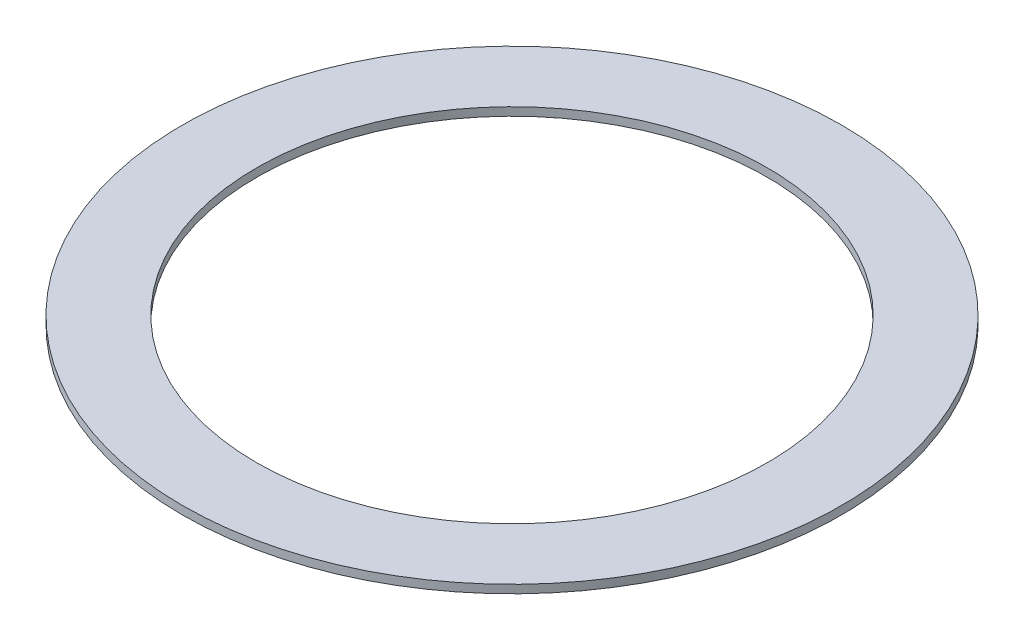
ISO-10303-21;
HEADER;
FILE_DESCRIPTION(('STEP AP214'),'2;1');
FILE_NAME('part.step','',(''),(''),'','','');
FILE_SCHEMA(('AUTOMOTIVE_DESIGN { 1 0 10303 214 1 1 1 1 }'));
ENDSEC;
DATA;
#1=APPLICATION_CONTEXT('core data for automotive mechanical design processes');
#2=APPLICATION_PROTOCOL_DEFINITION('international standard','automotive_design',2000,#1);
#3=PRODUCT_CONTEXT('',#1,'mechanical');
#4=PRODUCT('Part','Part','',(#3));
#5=PRODUCT_RELATED_PRODUCT_CATEGORY('part','',(#4));
#6=PRODUCT_DEFINITION_FORMATION('','',#4);
#7=PRODUCT_DEFINITION_CONTEXT('part definition',#1,'design');
#8=PRODUCT_DEFINITION('design','',#6,#7);
#9=PRODUCT_DEFINITION_SHAPE('','',#8);
#10=(LENGTH_UNIT() NAMED_UNIT(*) SI_UNIT(.MILLI.,.METRE.));
#11=(NAMED_UNIT(*) PLANE_ANGLE_UNIT() SI_UNIT($,.RADIAN.));
#12=(NAMED_UNIT(*) SI_UNIT($,.STERADIAN.) SOLID_ANGLE_UNIT());
#13=UNCERTAINTY_MEASURE_WITH_UNIT(LENGTH_MEASURE(1.E-05),#10,'distance_accuracy_value','');
#14=(GEOMETRIC_REPRESENTATION_CONTEXT(3) GLOBAL_UNCERTAINTY_ASSIGNED_CONTEXT((#13)) GLOBAL_UNIT_ASSIGNED_CONTEXT((#10,
#11,#12)) REPRESENTATION_CONTEXT('',''));
#15=CARTESIAN_POINT('',(0.,0.,0.));
#16=DIRECTION('',(0.,0.,1.));
#17=DIRECTION('',(1.,0.,0.));
#18=AXIS2_PLACEMENT_3D('',#15,#16,#17);
#19=CARTESIAN_POINT('',(0.,0.5,0.));
#20=DIRECTION('',(0.,1.,0.));
#21=DIRECTION('',(0.,0.,1.));
#22=AXIS2_PLACEMENT_3D('',#19,#20,#21);
#23=PLANE('',#22);
#24=CARTESIAN_POINT('',(0.,0.5,0.));
#25=DIRECTION('',(0.,1.,0.));
#26=DIRECTION('',(0.,0.,1.));
#27=AXIS2_PLACEMENT_3D('',#24,#25,#26);
#28=CIRCLE('',#27,20.);
#29=CARTESIAN_POINT('',(0.,0.5,20.));
#30=VERTEX_POINT('',#29);
#31=EDGE_CURVE('E10',#30,#30,#28,.T.);
#32=ORIENTED_EDGE('',*,*,#31,.T.);
#33=EDGE_LOOP('',(#32));
#34=FACE_BOUND('',#33,.T.);
#35=CARTESIAN_POINT('',(0.,0.5,0.));
#36=DIRECTION('',(0.,1.,0.));
#37=DIRECTION('',(0.,0.,1.));
#38=AXIS2_PLACEMENT_3D('',#35,#36,#37);
#39=CIRCLE('',#38,15.5);
#40=CARTESIAN_POINT('',(0.,0.5,15.5));
#41=VERTEX_POINT('',#40);
#42=EDGE_CURVE('E45',#41,#41,#39,.T.);
#43=ORIENTED_EDGE('',*,*,#42,.F.);
#44=EDGE_LOOP('',(#43));
#45=FACE_BOUND('',#44,.T.);
#46=ADVANCED_FACE('F34',(#34,#45),#23,.T.);
#47=CARTESIAN_POINT('',(0.,0.,0.));
#48=DIRECTION('',(0.,1.,0.));
#49=DIRECTION('',(0.,0.,1.));
#50=AXIS2_PLACEMENT_3D('',#47,#48,#49);
#51=PLANE('',#50);
#52=CARTESIAN_POINT('',(0.,0.,0.));
#53=DIRECTION('',(0.,1.,0.));
#54=DIRECTION('',(0.,0.,1.));
#55=AXIS2_PLACEMENT_3D('',#52,#53,#54);
#56=CIRCLE('',#55,20.);
#57=CARTESIAN_POINT('',(0.,0.,20.));
#58=VERTEX_POINT('',#57);
#59=EDGE_CURVE('E38',#58,#58,#56,.T.);
#60=ORIENTED_EDGE('',*,*,#59,.F.);
#61=EDGE_LOOP('',(#60));
#62=FACE_BOUND('',#61,.T.);
#63=CARTESIAN_POINT('',(0.,0.,0.));
#64=DIRECTION('',(0.,1.,0.));
#65=DIRECTION('',(0.,0.,1.));
#66=AXIS2_PLACEMENT_3D('',#63,#64,#65);
#67=CIRCLE('',#66,15.5);
#68=CARTESIAN_POINT('',(0.,0.,15.5));
#69=VERTEX_POINT('',#68);
#70=EDGE_CURVE('E47',#69,#69,#67,.T.);
#71=ORIENTED_EDGE('',*,*,#70,.T.);
#72=EDGE_LOOP('',(#71));
#73=FACE_BOUND('',#72,.T.);
#74=ADVANCED_FACE('F57',(#62,#73),#51,.F.);
#75=CARTESIAN_POINT('',(0.,0.5,0.));
#76=DIRECTION('',(0.,-1.,0.));
#77=DIRECTION('',(0.,0.,-1.));
#78=AXIS2_PLACEMENT_3D('',#75,#76,#77);
#79=CYLINDRICAL_SURFACE('',#78,20.);
#80=ORIENTED_EDGE('',*,*,#31,.F.);
#81=EDGE_LOOP('',(#80));
#82=FACE_BOUND('',#81,.T.);
#83=ORIENTED_EDGE('',*,*,#59,.T.);
#84=EDGE_LOOP('',(#83));
#85=FACE_BOUND('',#84,.T.);
#86=ADVANCED_FACE('F36',(#82,#85),#79,.T.);
#87=CARTESIAN_POINT('',(0.,0.5,0.));
#88=DIRECTION('',(0.,-1.,0.));
#89=DIRECTION('',(0.,0.,-1.));
#90=AXIS2_PLACEMENT_3D('',#87,#88,#89);
#91=CYLINDRICAL_SURFACE('',#90,15.5);
#92=ORIENTED_EDGE('',*,*,#42,.T.);
#93=EDGE_LOOP('',(#92));
#94=FACE_BOUND('',#93,.T.);
#95=ORIENTED_EDGE('',*,*,#70,.F.);
#96=EDGE_LOOP('',(#95));
#97=FACE_BOUND('',#96,.T.);
#98=ADVANCED_FACE('F53',(#94,#97),#91,.F.);
#99=CLOSED_SHELL('',(#46,#74,#86,#98));
#100=MANIFOLD_SOLID_BREP('B2',#99);
#101=ADVANCED_BREP_SHAPE_REPRESENTATION('',(#18,#100),#14);
#102=SHAPE_DEFINITION_REPRESENTATION(#9,#101);
ENDSEC;
END-ISO-10303-21;
